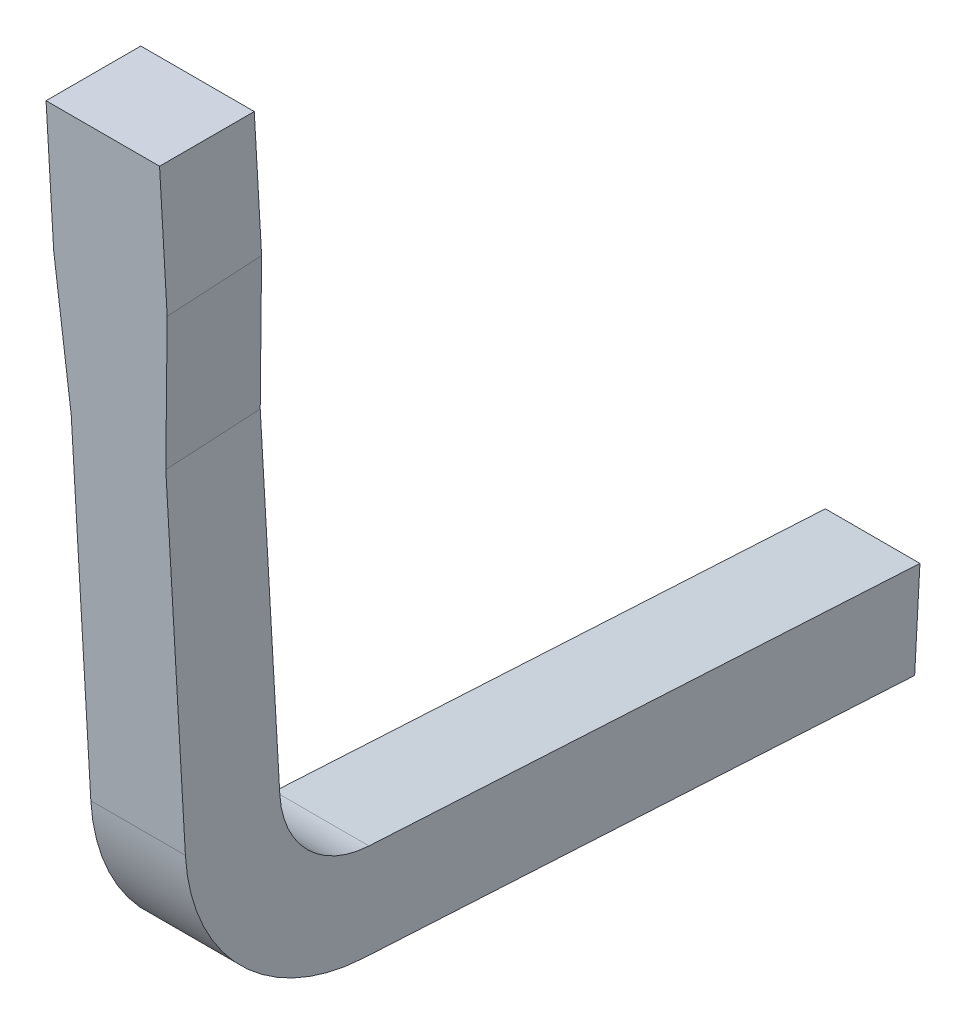
ISO-10303-21;
HEADER;
FILE_DESCRIPTION(('STEP AP214'),'2;1');
FILE_NAME('part.step','',(''),(''),'','','');
FILE_SCHEMA(('AUTOMOTIVE_DESIGN { 1 0 10303 214 1 1 1 1 }'));
ENDSEC;
DATA;
#1=APPLICATION_CONTEXT('core data for automotive mechanical design processes');
#2=APPLICATION_PROTOCOL_DEFINITION('international standard','automotive_design',2000,#1);
#3=PRODUCT_CONTEXT('',#1,'mechanical');
#4=PRODUCT('Part','Part','',(#3));
#5=PRODUCT_RELATED_PRODUCT_CATEGORY('part','',(#4));
#6=PRODUCT_DEFINITION_FORMATION('','',#4);
#7=PRODUCT_DEFINITION_CONTEXT('part definition',#1,'design');
#8=PRODUCT_DEFINITION('design','',#6,#7);
#9=PRODUCT_DEFINITION_SHAPE('','',#8);
#10=(LENGTH_UNIT() NAMED_UNIT(*) SI_UNIT(.MILLI.,.METRE.));
#11=(NAMED_UNIT(*) PLANE_ANGLE_UNIT() SI_UNIT($,.RADIAN.));
#12=(NAMED_UNIT(*) SI_UNIT($,.STERADIAN.) SOLID_ANGLE_UNIT());
#13=UNCERTAINTY_MEASURE_WITH_UNIT(LENGTH_MEASURE(1.E-05),#10,'distance_accuracy_value','');
#14=(GEOMETRIC_REPRESENTATION_CONTEXT(3) GLOBAL_UNCERTAINTY_ASSIGNED_CONTEXT((#13)) GLOBAL_UNIT_ASSIGNED_CONTEXT((#10,
#11,#12)) REPRESENTATION_CONTEXT('',''));
#15=CARTESIAN_POINT('',(0.,0.,0.));
#16=DIRECTION('',(0.,0.,1.));
#17=DIRECTION('',(1.,0.,0.));
#18=AXIS2_PLACEMENT_3D('',#15,#16,#17);
#19=CARTESIAN_POINT('',(1.88,-1.879082198882,-10.32387202233));
#20=DIRECTION('',(1.,0.,0.));
#21=DIRECTION('',(0.,0.,-1.));
#22=AXIS2_PLACEMENT_3D('',#19,#20,#21);
#23=PLANE('',#22);
#24=DIRECTION('',(1.7997756063594E-13,-0.0569406083160465,0.998377567418559));
#25=VECTOR('',#24,1.);
#26=CARTESIAN_POINT('',(1.88,-2.014836222708,-10.43177700759));
#27=LINE('',#26,#25);
#28=CARTESIAN_POINT('',(1.88,-2.01483622270796,-10.4317770075908));
#29=VERTEX_POINT('',#28);
#30=CARTESIAN_POINT('',(1.88000000000001,-2.02622434437119,-10.2321014941066));
#31=VERTEX_POINT('',#30);
#32=EDGE_CURVE('E183',#29,#31,#27,.T.);
#33=ORIENTED_EDGE('',*,*,#32,.T.);
#34=DIRECTION('',(0.,-0.998377567418999,-0.0569406083083299));
#35=VECTOR('',#34,1.);
#36=CARTESIAN_POINT('',(1.88,-2.398052209196,-10.25330800505));
#37=LINE('',#36,#35);
#38=CARTESIAN_POINT('',(1.88,-1.74332817505504,-10.2159670370689));
#39=VERTEX_POINT('',#38);
#40=EDGE_CURVE('E180',#39,#31,#37,.T.);
#41=ORIENTED_EDGE('',*,*,#40,.F.);
#42=DIRECTION('',(0.,0.,1.));
#43=VECTOR('',#42,1.);
#44=CARTESIAN_POINT('',(1.88,-1.743328175055,-10.31612954398));
#45=LINE('',#44,#43);
#46=CARTESIAN_POINT('',(1.88,-1.74332817505473,-10.4162920508947));
#47=VERTEX_POINT('',#46);
#48=EDGE_CURVE('E175',#47,#39,#45,.T.);
#49=ORIENTED_EDGE('',*,*,#48,.F.);
#50=DIRECTION('',(0.,-0.998377567418624,-0.0569406083148914));
#51=VECTOR('',#50,1.);
#52=CARTESIAN_POINT('',(1.88,-2.392358148368,-10.45330826871));
#53=LINE('',#52,#51);
#54=EDGE_CURVE('E205',#47,#29,#53,.T.);
#55=ORIENTED_EDGE('',*,*,#54,.T.);
#56=EDGE_LOOP('',(#33,#41,#49,#55));
#57=FACE_BOUND('',#56,.T.);
#58=ADVANCED_FACE('F17',(#57),#23,.F.);
#59=CARTESIAN_POINT('',(1.89,-2.170286918652,-10.3404803421));
#60=DIRECTION('',(0.997785157856611,0.0664110879137908,0.00378763292362404));
#61=DIRECTION('',(-0.066411564291068,0.99779231512796,0.));
#62=AXIS2_PLACEMENT_3D('',#59,#60,#61);
#63=PLANE('',#62);
#64=DIRECTION('',(0.0665190105237393,-0.996166318707665,-0.0568144938493813));
#65=VECTOR('',#64,1.);
#66=CARTESIAN_POINT('',(1.88,-2.02622434437119,-10.2321014941066));
#67=LINE('',#66,#65);
#68=CARTESIAN_POINT('',(1.9,-2.32573761459706,-10.2491836765991));
#69=VERTEX_POINT('',#68);
#70=EDGE_CURVE('E161',#31,#69,#67,.T.);
#71=ORIENTED_EDGE('',*,*,#70,.F.);
#72=ORIENTED_EDGE('',*,*,#32,.F.);
#73=DIRECTION('',(0.0665190105237394,-0.996166318707292,-0.0568144938559241));
#74=VECTOR('',#73,1.);
#75=CARTESIAN_POINT('',(1.88,-2.01483622270793,-10.4317770075911));
#76=LINE('',#75,#74);
#77=CARTESIAN_POINT('',(1.9,-2.31434949293379,-10.4488591900838));
#78=VERTEX_POINT('',#77);
#79=EDGE_CURVE('E115',#29,#78,#76,.T.);
#80=ORIENTED_EDGE('',*,*,#79,.T.);
#81=DIRECTION('',(0.,-0.0569406083160594,0.998377567418558));
#82=VECTOR('',#81,1.);
#83=CARTESIAN_POINT('',(1.9,-2.314349492934,-10.44885919008));
#84=LINE('',#83,#82);
#85=EDGE_CURVE('E110',#78,#69,#84,.T.);
#86=ORIENTED_EDGE('',*,*,#85,.T.);
#87=EDGE_LOOP('',(#71,#72,#80,#86));
#88=FACE_BOUND('',#87,.T.);
#89=ADVANCED_FACE('F288',(#88),#63,.F.);
#90=CARTESIAN_POINT('',(2.12,-1.879082198882,-10.32387202233));
#91=DIRECTION('',(1.,0.,0.));
#92=DIRECTION('',(0.,0.,-1.));
#93=AXIS2_PLACEMENT_3D('',#90,#91,#92);
#94=PLANE('',#93);
#95=DIRECTION('',(0.,-0.998377567418624,-0.0569406083148914));
#96=VECTOR('',#95,1.);
#97=CARTESIAN_POINT('',(2.12,-2.392358148368,-10.45330826871));
#98=LINE('',#97,#96);
#99=CARTESIAN_POINT('',(2.12000000000005,-2.01483622270898,-10.4317770075904));
#100=VERTEX_POINT('',#99);
#101=CARTESIAN_POINT('',(2.12,-1.74332817505473,-10.4162920508947));
#102=VERTEX_POINT('',#101);
#103=EDGE_CURVE('E128',#100,#102,#98,.F.);
#104=ORIENTED_EDGE('',*,*,#103,.T.);
#105=DIRECTION('',(0.,0.,1.));
#106=VECTOR('',#105,1.);
#107=CARTESIAN_POINT('',(2.12,-1.743328175055,-10.31612954398));
#108=LINE('',#107,#106);
#109=CARTESIAN_POINT('',(2.12,-1.74332817505504,-10.2159670370692));
#110=VERTEX_POINT('',#109);
#111=EDGE_CURVE('E185',#110,#102,#108,.F.);
#112=ORIENTED_EDGE('',*,*,#111,.F.);
#113=DIRECTION('',(0.,-0.998377567418999,-0.0569406083083299));
#114=VECTOR('',#113,1.);
#115=CARTESIAN_POINT('',(2.12,-2.398052209196,-10.25330800505));
#116=LINE('',#115,#114);
#117=CARTESIAN_POINT('',(2.12000000000002,-2.0262243443712,-10.2321014941066));
#118=VERTEX_POINT('',#117);
#119=EDGE_CURVE('E168',#118,#110,#116,.F.);
#120=ORIENTED_EDGE('',*,*,#119,.F.);
#121=DIRECTION('',(0.,-0.0569406083110753,0.998377567418842));
#122=VECTOR('',#121,1.);
#123=CARTESIAN_POINT('',(2.12000000000007,-2.014836222709,-10.43177700759));
#124=LINE('',#123,#122);
#125=EDGE_CURVE('E131',#100,#118,#124,.T.);
#126=ORIENTED_EDGE('',*,*,#125,.F.);
#127=EDGE_LOOP('',(#104,#112,#120,#126));
#128=FACE_BOUND('',#127,.T.);
#129=ADVANCED_FACE('F251',(#128),#94,.T.);
#130=CARTESIAN_POINT('',(2.,-1.743328175055,-10.31612954398));
#131=DIRECTION('',(0.,1.,0.));
#132=DIRECTION('',(0.,0.,1.));
#133=AXIS2_PLACEMENT_3D('',#130,#131,#132);
#134=PLANE('',#133);
#135=DIRECTION('',(1.,0.,0.));
#136=VECTOR('',#135,1.);
#137=CARTESIAN_POINT('',(2.,-1.74332817505459,-10.4162920508971));
#138=LINE('',#137,#136);
#139=EDGE_CURVE('E138',#102,#47,#138,.F.);
#140=ORIENTED_EDGE('',*,*,#139,.T.);
#141=ORIENTED_EDGE('',*,*,#48,.T.);
#142=DIRECTION('',(1.,0.,0.));
#143=VECTOR('',#142,1.);
#144=CARTESIAN_POINT('',(2.,-1.74332817505506,-10.2159670370689));
#145=LINE('',#144,#143);
#146=EDGE_CURVE('E171',#110,#39,#145,.F.);
#147=ORIENTED_EDGE('',*,*,#146,.F.);
#148=ORIENTED_EDGE('',*,*,#111,.T.);
#149=EDGE_LOOP('',(#140,#141,#147,#148));
#150=FACE_BOUND('',#149,.T.);
#151=ADVANCED_FACE('F291',(#150),#134,.T.);
#152=CARTESIAN_POINT('',(1.9,-2.898875732105,-11.04167004462));
#153=DIRECTION('',(1.,0.,0.));
#154=DIRECTION('',(0.,0.,-1.));
#155=AXIS2_PLACEMENT_3D('',#152,#153,#154);
#156=PLANE('',#155);
#157=CARTESIAN_POINT('',(1.9,-3.03,-10.69));
#158=DIRECTION('',(-1.,0.,0.));
#159=DIRECTION('',(0.,0.,1.));
#160=AXIS2_PLACEMENT_3D('',#157,#158,#159);
#161=CIRCLE('',#160,0.4);
#162=CARTESIAN_POINT('',(1.9,-3.05277624332116,-10.2906489730313));
#163=VERTEX_POINT('',#162);
#164=CARTESIAN_POINT('',(1.9,-3.42937693582933,-10.6676826720305));
#165=VERTEX_POINT('',#164);
#166=EDGE_CURVE('E155',#163,#165,#161,.F.);
#167=ORIENTED_EDGE('',*,*,#166,.F.);
#168=DIRECTION('',(0.,-0.998377567418999,-0.0569406083083299));
#169=VECTOR('',#168,1.);
#170=CARTESIAN_POINT('',(1.9,-2.398052209196,-10.25330800505));
#171=LINE('',#170,#169);
#172=EDGE_CURVE('E158',#69,#163,#171,.T.);
#173=ORIENTED_EDGE('',*,*,#172,.F.);
#174=ORIENTED_EDGE('',*,*,#85,.F.);
#175=DIRECTION('',(0.,-0.998377567418624,-0.0569406083148914));
#176=VECTOR('',#175,1.);
#177=CARTESIAN_POINT('',(1.9,-2.392358148368,-10.45330826871));
#178=LINE('',#177,#176);
#179=CARTESIAN_POINT('',(1.9,-3.0413881216286,-10.4903244865199));
#180=VERTEX_POINT('',#179);
#181=EDGE_CURVE('E104',#78,#180,#178,.T.);
#182=ORIENTED_EDGE('',*,*,#181,.T.);
#183=CARTESIAN_POINT('',(1.9,-3.03,-10.69));
#184=DIRECTION('',(-1.,0.,0.));
#185=DIRECTION('',(0.,0.,1.));
#186=AXIS2_PLACEMENT_3D('',#183,#184,#185);
#187=CIRCLE('',#186,0.2);
#188=CARTESIAN_POINT('',(1.9,-3.22968846791482,-10.6788413360177));
#189=VERTEX_POINT('',#188);
#190=EDGE_CURVE('E20',#180,#189,#187,.F.);
#191=ORIENTED_EDGE('',*,*,#190,.T.);
#192=DIRECTION('',(0.,0.0557933199228295,0.998442339572991));
#193=VECTOR('',#192,1.);
#194=CARTESIAN_POINT('',(1.9,-3.262244863925,-11.26145022621));
#195=LINE('',#194,#193);
#196=CARTESIAN_POINT('',(1.9,-3.29480125993501,-11.8440591164004));
#197=VERTEX_POINT('',#196);
#198=EDGE_CURVE('E123',#197,#189,#195,.T.);
#199=ORIENTED_EDGE('',*,*,#198,.F.);
#200=DIRECTION('',(0.,-0.998442339574031,0.0557933199042218));
#201=VECTOR('',#200,1.);
#202=CARTESIAN_POINT('',(1.9,-3.394645493892,-11.83847978441));
#203=LINE('',#202,#201);
#204=CARTESIAN_POINT('',(1.9,-3.49448972784906,-11.8329004524196));
#205=VERTEX_POINT('',#204);
#206=EDGE_CURVE('E148',#197,#205,#203,.T.);
#207=ORIENTED_EDGE('',*,*,#206,.T.);
#208=DIRECTION('',(0.,0.055793319922371,0.998442339573017));
#209=VECTOR('',#208,1.);
#210=CARTESIAN_POINT('',(1.9,-3.461933331839,-11.25029156222));
#211=LINE('',#210,#209);
#212=EDGE_CURVE('E153',#205,#165,#211,.T.);
#213=ORIENTED_EDGE('',*,*,#212,.T.);
#214=EDGE_LOOP('',(#167,#173,#174,#182,#191,#199,#207,#213));
#215=FACE_BOUND('',#214,.T.);
#216=ADVANCED_FACE('F107',(#215),#156,.F.);
#217=CARTESIAN_POINT('',(2.,-3.262244863925,-11.26145022621));
#218=DIRECTION('',(0.,0.998442339572991,-0.0557933199228295));
#219=DIRECTION('',(0.,0.0557933199228295,0.998442339572991));
#220=AXIS2_PLACEMENT_3D('',#217,#218,#219);
#221=PLANE('',#220);
#222=DIRECTION('',(0.,0.055793319922887,0.998442339572988));
#223=VECTOR('',#222,1.);
#224=CARTESIAN_POINT('',(2.1,-3.294801259935,-11.8440591164));
#225=LINE('',#224,#223);
#226=CARTESIAN_POINT('',(2.1,-3.29480125993501,-11.8440591164001));
#227=VERTEX_POINT('',#226);
#228=CARTESIAN_POINT('',(2.1,-3.2296884679148,-10.6788413360177));
#229=VERTEX_POINT('',#228);
#230=EDGE_CURVE('E142',#227,#229,#225,.T.);
#231=ORIENTED_EDGE('',*,*,#230,.F.);
#232=DIRECTION('',(1.,0.,0.));
#233=VECTOR('',#232,1.);
#234=CARTESIAN_POINT('',(2.,-3.29480125993502,-11.8440591164004));
#235=LINE('',#234,#233);
#236=EDGE_CURVE('E139',#227,#197,#235,.F.);
#237=ORIENTED_EDGE('',*,*,#236,.T.);
#238=ORIENTED_EDGE('',*,*,#198,.T.);
#239=DIRECTION('',(-1.,0.,0.));
#240=VECTOR('',#239,1.);
#241=CARTESIAN_POINT('',(2.104,-3.22968846791485,-10.67884133602));
#242=LINE('',#241,#240);
#243=EDGE_CURVE('E122',#189,#229,#242,.F.);
#244=ORIENTED_EDGE('',*,*,#243,.T.);
#245=EDGE_LOOP('',(#231,#237,#238,#244));
#246=FACE_BOUND('',#245,.T.);
#247=ADVANCED_FACE('F284',(#246),#221,.T.);
#248=CARTESIAN_POINT('',(2.104,-3.03,-10.69));
#249=DIRECTION('',(-1.,0.,0.));
#250=DIRECTION('',(0.,0.,1.));
#251=AXIS2_PLACEMENT_3D('',#248,#249,#250);
#252=CYLINDRICAL_SURFACE('',#251,0.2);
#253=ORIENTED_EDGE('',*,*,#190,.F.);
#254=DIRECTION('',(1.,0.,0.));
#255=VECTOR('',#254,1.);
#256=CARTESIAN_POINT('',(2.,-3.04138812159455,-10.4903244865179));
#257=LINE('',#256,#255);
#258=CARTESIAN_POINT('',(2.1,-3.04138812162905,-10.4903244865184));
#259=VERTEX_POINT('',#258);
#260=EDGE_CURVE('E114',#180,#259,#257,.T.);
#261=ORIENTED_EDGE('',*,*,#260,.T.);
#262=CARTESIAN_POINT('',(2.1,-3.03,-10.69));
#263=DIRECTION('',(-1.,0.,0.));
#264=DIRECTION('',(0.,0.,1.));
#265=AXIS2_PLACEMENT_3D('',#262,#263,#264);
#266=CIRCLE('',#265,0.2);
#267=EDGE_CURVE('E223',#229,#259,#266,.T.);
#268=ORIENTED_EDGE('',*,*,#267,.F.);
#269=ORIENTED_EDGE('',*,*,#243,.F.);
#270=EDGE_LOOP('',(#253,#261,#268,#269));
#271=FACE_BOUND('',#270,.T.);
#272=ADVANCED_FACE('F119',(#271),#252,.F.);
#273=CARTESIAN_POINT('',(2.,-2.392358148368,-10.45330826871));
#274=DIRECTION('',(0.,-0.0569406083148914,0.998377567418624));
#275=DIRECTION('',(0.,-0.998377567418624,-0.0569406083148914));
#276=AXIS2_PLACEMENT_3D('',#273,#274,#275);
#277=PLANE('',#276);
#278=DIRECTION('',(0.0665190105240592,0.996166318708109,0.0568144938412267));
#279=VECTOR('',#278,1.);
#280=CARTESIAN_POINT('',(2.10000000000004,-2.314349492934,-10.44885919008));
#281=LINE('',#280,#279);
#282=CARTESIAN_POINT('',(2.10000000000001,-2.314349492934,-10.44885919008));
#283=VERTEX_POINT('',#282);
#284=EDGE_CURVE('E165',#283,#100,#281,.T.);
#285=ORIENTED_EDGE('',*,*,#284,.F.);
#286=DIRECTION('',(0.,0.998377567418421,0.0569406083184697));
#287=VECTOR('',#286,1.);
#288=CARTESIAN_POINT('',(2.1,-3.041388121684,-10.49032448652));
#289=LINE('',#288,#287);
#290=EDGE_CURVE('E126',#259,#283,#289,.T.);
#291=ORIENTED_EDGE('',*,*,#290,.F.);
#292=ORIENTED_EDGE('',*,*,#260,.F.);
#293=ORIENTED_EDGE('',*,*,#181,.F.);
#294=ORIENTED_EDGE('',*,*,#79,.F.);
#295=ORIENTED_EDGE('',*,*,#54,.F.);
#296=ORIENTED_EDGE('',*,*,#139,.F.);
#297=ORIENTED_EDGE('',*,*,#103,.F.);
#298=EDGE_LOOP('',(#285,#291,#292,#293,#294,#295,#296,#297));
#299=FACE_BOUND('',#298,.T.);
#300=ADVANCED_FACE('F124',(#299),#277,.F.);
#301=CARTESIAN_POINT('',(2.11,-2.170286918653,-10.3404803421));
#302=DIRECTION('',(0.99778515785659,-0.0664110879141193,-0.00378763292348296));
#303=DIRECTION('',(0.0664115642913965,0.997792315127938,0.));
#304=AXIS2_PLACEMENT_3D('',#301,#302,#303);
#305=PLANE('',#304);
#306=DIRECTION('',(0.,-0.0569406083160594,0.998377567418558));
#307=VECTOR('',#306,1.);
#308=CARTESIAN_POINT('',(2.1,-2.314349492934,-10.44885919008));
#309=LINE('',#308,#307);
#310=CARTESIAN_POINT('',(2.1,-2.32573761459702,-10.2491836765997));
#311=VERTEX_POINT('',#310);
#312=EDGE_CURVE('E238',#283,#311,#309,.T.);
#313=ORIENTED_EDGE('',*,*,#312,.F.);
#314=ORIENTED_EDGE('',*,*,#284,.T.);
#315=ORIENTED_EDGE('',*,*,#125,.T.);
#316=DIRECTION('',(0.0665190105237393,0.996166318707665,0.0568144938493813));
#317=VECTOR('',#316,1.);
#318=CARTESIAN_POINT('',(2.1,-2.32573761459705,-10.2491836765991));
#319=LINE('',#318,#317);
#320=EDGE_CURVE('E160',#311,#118,#319,.T.);
#321=ORIENTED_EDGE('',*,*,#320,.F.);
#322=EDGE_LOOP('',(#313,#314,#315,#321));
#323=FACE_BOUND('',#322,.T.);
#324=ADVANCED_FACE('F245',(#323),#305,.T.);
#325=CARTESIAN_POINT('',(2.,-2.398052209196,-10.25330800505));
#326=DIRECTION('',(0.,-0.0569406083083299,0.998377567418999));
#327=DIRECTION('',(0.,-0.998377567418999,-0.0569406083083299));
#328=AXIS2_PLACEMENT_3D('',#325,#326,#327);
#329=PLANE('',#328);
#330=ORIENTED_EDGE('',*,*,#119,.T.);
#331=ORIENTED_EDGE('',*,*,#146,.T.);
#332=ORIENTED_EDGE('',*,*,#40,.T.);
#333=ORIENTED_EDGE('',*,*,#70,.T.);
#334=ORIENTED_EDGE('',*,*,#172,.T.);
#335=DIRECTION('',(-1.,0.,0.));
#336=VECTOR('',#335,1.);
#337=CARTESIAN_POINT('',(2.104,-3.05277624331888,-10.2906489730321));
#338=LINE('',#337,#336);
#339=CARTESIAN_POINT('',(2.1,-3.05277624332089,-10.2906489730312));
#340=VERTEX_POINT('',#339);
#341=EDGE_CURVE('E198',#340,#163,#338,.T.);
#342=ORIENTED_EDGE('',*,*,#341,.F.);
#343=DIRECTION('',(0.,-0.998377567419076,-0.0569406083069694));
#344=VECTOR('',#343,1.);
#345=CARTESIAN_POINT('',(2.1,-2.325737614597,-10.2491836766));
#346=LINE('',#345,#344);
#347=EDGE_CURVE('E222',#311,#340,#346,.T.);
#348=ORIENTED_EDGE('',*,*,#347,.F.);
#349=ORIENTED_EDGE('',*,*,#320,.T.);
#350=EDGE_LOOP('',(#330,#331,#332,#333,#334,#342,#348,#349));
#351=FACE_BOUND('',#350,.T.);
#352=ADVANCED_FACE('F255',(#351),#329,.T.);
#353=CARTESIAN_POINT('',(2.104,-3.03,-10.69));
#354=DIRECTION('',(-1.,0.,0.));
#355=DIRECTION('',(0.,0.,1.));
#356=AXIS2_PLACEMENT_3D('',#353,#354,#355);
#357=CYLINDRICAL_SURFACE('',#356,0.4);
#358=DIRECTION('',(1.,0.,0.));
#359=VECTOR('',#358,1.);
#360=CARTESIAN_POINT('',(2.,-3.4293769358293,-10.66768267203));
#361=LINE('',#360,#359);
#362=CARTESIAN_POINT('',(2.1,-3.42937693582946,-10.6676826720306));
#363=VERTEX_POINT('',#362);
#364=EDGE_CURVE('E150',#165,#363,#361,.T.);
#365=ORIENTED_EDGE('',*,*,#364,.T.);
#366=CARTESIAN_POINT('',(2.1,-3.03,-10.69));
#367=DIRECTION('',(-1.,0.,0.));
#368=DIRECTION('',(0.,0.,1.));
#369=AXIS2_PLACEMENT_3D('',#366,#367,#368);
#370=CIRCLE('',#369,0.4);
#371=EDGE_CURVE('E219',#340,#363,#370,.F.);
#372=ORIENTED_EDGE('',*,*,#371,.F.);
#373=ORIENTED_EDGE('',*,*,#341,.T.);
#374=ORIENTED_EDGE('',*,*,#166,.T.);
#375=EDGE_LOOP('',(#365,#372,#373,#374));
#376=FACE_BOUND('',#375,.T.);
#377=ADVANCED_FACE('F273',(#376),#357,.T.);
#378=CARTESIAN_POINT('',(2.,-3.461933331839,-11.25029156222));
#379=DIRECTION('',(0.,0.998442339573017,-0.055793319922371));
#380=DIRECTION('',(0.,0.055793319922371,0.998442339573017));
#381=AXIS2_PLACEMENT_3D('',#378,#379,#380);
#382=PLANE('',#381);
#383=ORIENTED_EDGE('',*,*,#364,.F.);
#384=ORIENTED_EDGE('',*,*,#212,.F.);
#385=DIRECTION('',(1.,0.,0.));
#386=VECTOR('',#385,1.);
#387=CARTESIAN_POINT('',(2.,-3.49448972784898,-11.8329004524196));
#388=LINE('',#387,#386);
#389=CARTESIAN_POINT('',(2.1,-3.49448972784899,-11.8329004524199));
#390=VERTEX_POINT('',#389);
#391=EDGE_CURVE('E35',#205,#390,#388,.T.);
#392=ORIENTED_EDGE('',*,*,#391,.T.);
#393=DIRECTION('',(0.,-0.0557933199219327,-0.998442339573042));
#394=VECTOR('',#393,1.);
#395=CARTESIAN_POINT('',(2.1,-3.429376935829,-10.66768267202));
#396=LINE('',#395,#394);
#397=EDGE_CURVE('E26',#363,#390,#396,.T.);
#398=ORIENTED_EDGE('',*,*,#397,.F.);
#399=EDGE_LOOP('',(#383,#384,#392,#398));
#400=FACE_BOUND('',#399,.T.);
#401=ADVANCED_FACE('F274',(#400),#382,.F.);
#402=CARTESIAN_POINT('',(2.,-3.394645493892,-11.83847978441));
#403=DIRECTION('',(0.,0.0557933199042218,0.998442339574031));
#404=DIRECTION('',(0.,-0.998442339574031,0.0557933199042218));
#405=AXIS2_PLACEMENT_3D('',#402,#403,#404);
#406=PLANE('',#405);
#407=DIRECTION('',(0.,0.998442339574254,-0.0557933199002383));
#408=VECTOR('',#407,1.);
#409=CARTESIAN_POINT('',(2.1,-3.494489727849,-11.83290045242));
#410=LINE('',#409,#408);
#411=EDGE_CURVE('E11',#390,#227,#410,.T.);
#412=ORIENTED_EDGE('',*,*,#411,.F.);
#413=ORIENTED_EDGE('',*,*,#391,.F.);
#414=ORIENTED_EDGE('',*,*,#206,.F.);
#415=ORIENTED_EDGE('',*,*,#236,.F.);
#416=EDGE_LOOP('',(#412,#413,#414,#415));
#417=FACE_BOUND('',#416,.T.);
#418=ADVANCED_FACE('F281',(#417),#406,.F.);
#419=CARTESIAN_POINT('',(2.1,-2.909472777839,-11.05227927458));
#420=DIRECTION('',(1.,0.,0.));
#421=DIRECTION('',(0.,0.,-1.));
#422=AXIS2_PLACEMENT_3D('',#419,#420,#421);
#423=PLANE('',#422);
#424=ORIENTED_EDGE('',*,*,#397,.T.);
#425=ORIENTED_EDGE('',*,*,#411,.T.);
#426=ORIENTED_EDGE('',*,*,#230,.T.);
#427=ORIENTED_EDGE('',*,*,#267,.T.);
#428=ORIENTED_EDGE('',*,*,#290,.T.);
#429=ORIENTED_EDGE('',*,*,#312,.T.);
#430=ORIENTED_EDGE('',*,*,#347,.T.);
#431=ORIENTED_EDGE('',*,*,#371,.T.);
#432=EDGE_LOOP('',(#424,#425,#426,#427,#428,#429,#430,#431));
#433=FACE_BOUND('',#432,.T.);
#434=ADVANCED_FACE('F260',(#433),#423,.T.);
#435=CLOSED_SHELL('',(#58,#89,#129,#151,#216,#247,#272,#300,#324,#352,#377,#401,#418,#434));
#436=MANIFOLD_SOLID_BREP('B1',#435);
#437=ADVANCED_BREP_SHAPE_REPRESENTATION('',(#18,#436),#14);
#438=SHAPE_DEFINITION_REPRESENTATION(#9,#437);
ENDSEC;
END-ISO-10303-21;
